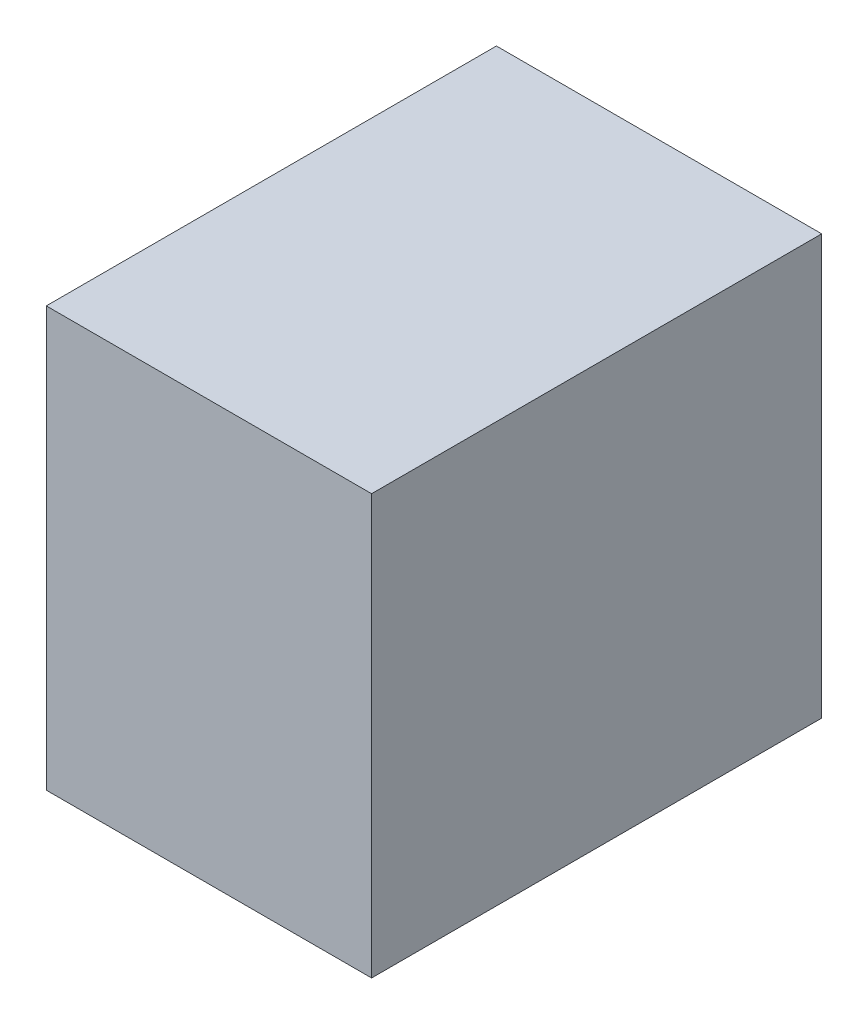
ISO-10303-21;
HEADER;
FILE_DESCRIPTION(('STEP AP214'),'2;1');
FILE_NAME('part.step','',(''),(''),'','','');
FILE_SCHEMA(('AUTOMOTIVE_DESIGN { 1 0 10303 214 1 1 1 1 }'));
ENDSEC;
DATA;
#1=APPLICATION_CONTEXT('core data for automotive mechanical design processes');
#2=APPLICATION_PROTOCOL_DEFINITION('international standard','automotive_design',2000,#1);
#3=PRODUCT_CONTEXT('',#1,'mechanical');
#4=PRODUCT('Part','Part','',(#3));
#5=PRODUCT_RELATED_PRODUCT_CATEGORY('part','',(#4));
#6=PRODUCT_DEFINITION_FORMATION('','',#4);
#7=PRODUCT_DEFINITION_CONTEXT('part definition',#1,'design');
#8=PRODUCT_DEFINITION('design','',#6,#7);
#9=PRODUCT_DEFINITION_SHAPE('','',#8);
#10=(LENGTH_UNIT() NAMED_UNIT(*) SI_UNIT(.MILLI.,.METRE.));
#11=(NAMED_UNIT(*) PLANE_ANGLE_UNIT() SI_UNIT($,.RADIAN.));
#12=(NAMED_UNIT(*) SI_UNIT($,.STERADIAN.) SOLID_ANGLE_UNIT());
#13=UNCERTAINTY_MEASURE_WITH_UNIT(LENGTH_MEASURE(1.E-05),#10,'distance_accuracy_value','');
#14=(GEOMETRIC_REPRESENTATION_CONTEXT(3) GLOBAL_UNCERTAINTY_ASSIGNED_CONTEXT((#13)) GLOBAL_UNIT_ASSIGNED_CONTEXT((#10,
#11,#12)) REPRESENTATION_CONTEXT('',''));
#15=CARTESIAN_POINT('',(0.,0.,0.));
#16=DIRECTION('',(0.,0.,1.));
#17=DIRECTION('',(1.,0.,0.));
#18=AXIS2_PLACEMENT_3D('',#15,#16,#17);
#19=CARTESIAN_POINT('',(1.58999936,2.05000098,0.));
#20=DIRECTION('',(1.,0.,0.));
#21=DIRECTION('',(0.,0.,-1.));
#22=AXIS2_PLACEMENT_3D('',#19,#20,#21);
#23=PLANE('',#22);
#24=DIRECTION('',(0.,0.,-1.));
#25=VECTOR('',#24,1.);
#26=CARTESIAN_POINT('',(1.58999936,-2.05000098,0.));
#27=LINE('',#26,#25);
#28=CARTESIAN_POINT('',(1.58999936,-2.05000098,0.));
#29=VERTEX_POINT('',#28);
#30=CARTESIAN_POINT('',(1.58999936,-2.05000098,4.39999882));
#31=VERTEX_POINT('',#30);
#32=EDGE_CURVE('E20',#29,#31,#27,.F.);
#33=ORIENTED_EDGE('',*,*,#32,.F.);
#34=DIRECTION('',(0.,1.,0.));
#35=VECTOR('',#34,1.);
#36=CARTESIAN_POINT('',(1.58999936,-2.05000098,0.));
#37=LINE('',#36,#35);
#38=CARTESIAN_POINT('',(1.58999936,2.05000098,0.));
#39=VERTEX_POINT('',#38);
#40=EDGE_CURVE('E79',#29,#39,#37,.T.);
#41=ORIENTED_EDGE('',*,*,#40,.T.);
#42=DIRECTION('',(0.,0.,1.));
#43=VECTOR('',#42,1.);
#44=CARTESIAN_POINT('',(1.58999936,2.05000098,0.));
#45=LINE('',#44,#43);
#46=CARTESIAN_POINT('',(1.58999936,2.05000098,4.39999882));
#47=VERTEX_POINT('',#46);
#48=EDGE_CURVE('E61',#47,#39,#45,.F.);
#49=ORIENTED_EDGE('',*,*,#48,.F.);
#50=DIRECTION('',(0.,1.,0.));
#51=VECTOR('',#50,1.);
#52=CARTESIAN_POINT('',(1.58999936,-2.05000098,4.39999882));
#53=LINE('',#52,#51);
#54=EDGE_CURVE('E56',#31,#47,#53,.T.);
#55=ORIENTED_EDGE('',*,*,#54,.F.);
#56=EDGE_LOOP('',(#33,#41,#49,#55));
#57=FACE_BOUND('',#56,.T.);
#58=ADVANCED_FACE('F17',(#57),#23,.T.);
#59=CARTESIAN_POINT('',(1.58999936,-2.05000098,0.));
#60=DIRECTION('',(0.,-1.,0.));
#61=DIRECTION('',(0.,0.,-1.));
#62=AXIS2_PLACEMENT_3D('',#59,#60,#61);
#63=PLANE('',#62);
#64=DIRECTION('',(0.,0.,1.));
#65=VECTOR('',#64,1.);
#66=CARTESIAN_POINT('',(-1.58999936,-2.05000098,0.));
#67=LINE('',#66,#65);
#68=CARTESIAN_POINT('',(-1.58999936,-2.05000098,0.));
#69=VERTEX_POINT('',#68);
#70=CARTESIAN_POINT('',(-1.58999936,-2.05000098,4.39999882));
#71=VERTEX_POINT('',#70);
#72=EDGE_CURVE('E83',#69,#71,#67,.T.);
#73=ORIENTED_EDGE('',*,*,#72,.F.);
#74=DIRECTION('',(1.,0.,0.));
#75=VECTOR('',#74,1.);
#76=CARTESIAN_POINT('',(1.58999936,-2.05000098,0.));
#77=LINE('',#76,#75);
#78=EDGE_CURVE('E68',#69,#29,#77,.T.);
#79=ORIENTED_EDGE('',*,*,#78,.T.);
#80=ORIENTED_EDGE('',*,*,#32,.T.);
#81=DIRECTION('',(1.,0.,0.));
#82=VECTOR('',#81,1.);
#83=CARTESIAN_POINT('',(1.58999936,-2.05000098,4.39999882));
#84=LINE('',#83,#82);
#85=EDGE_CURVE('E63',#71,#31,#84,.T.);
#86=ORIENTED_EDGE('',*,*,#85,.F.);
#87=EDGE_LOOP('',(#73,#79,#80,#86));
#88=FACE_BOUND('',#87,.T.);
#89=ADVANCED_FACE('F65',(#88),#63,.T.);
#90=CARTESIAN_POINT('',(1.58999936,-2.05000098,4.39999882));
#91=DIRECTION('',(0.,0.,1.));
#92=DIRECTION('',(1.,0.,0.));
#93=AXIS2_PLACEMENT_3D('',#90,#91,#92);
#94=PLANE('',#93);
#95=DIRECTION('',(0.,1.,0.));
#96=VECTOR('',#95,1.);
#97=CARTESIAN_POINT('',(-1.58999936,-2.05000098,4.39999882));
#98=LINE('',#97,#96);
#99=CARTESIAN_POINT('',(-1.58999936,2.05000098,4.39999882));
#100=VERTEX_POINT('',#99);
#101=EDGE_CURVE('E72',#71,#100,#98,.T.);
#102=ORIENTED_EDGE('',*,*,#101,.F.);
#103=ORIENTED_EDGE('',*,*,#85,.T.);
#104=ORIENTED_EDGE('',*,*,#54,.T.);
#105=DIRECTION('',(1.,0.,0.));
#106=VECTOR('',#105,1.);
#107=CARTESIAN_POINT('',(-1.58999936,2.05000098,4.39999882));
#108=LINE('',#107,#106);
#109=EDGE_CURVE('E74',#100,#47,#108,.T.);
#110=ORIENTED_EDGE('',*,*,#109,.F.);
#111=EDGE_LOOP('',(#102,#103,#104,#110));
#112=FACE_BOUND('',#111,.T.);
#113=ADVANCED_FACE('F70',(#112),#94,.T.);
#114=CARTESIAN_POINT('',(-1.58999936,2.05000098,0.));
#115=DIRECTION('',(0.,1.,0.));
#116=DIRECTION('',(0.,0.,1.));
#117=AXIS2_PLACEMENT_3D('',#114,#115,#116);
#118=PLANE('',#117);
#119=ORIENTED_EDGE('',*,*,#48,.T.);
#120=DIRECTION('',(1.,0.,0.));
#121=VECTOR('',#120,1.);
#122=CARTESIAN_POINT('',(1.58999936,2.05000098,0.));
#123=LINE('',#122,#121);
#124=CARTESIAN_POINT('',(-1.58999936,2.05000098,0.));
#125=VERTEX_POINT('',#124);
#126=EDGE_CURVE('E35',#39,#125,#123,.F.);
#127=ORIENTED_EDGE('',*,*,#126,.T.);
#128=DIRECTION('',(0.,0.,1.));
#129=VECTOR('',#128,1.);
#130=CARTESIAN_POINT('',(-1.58999936,2.05000098,0.));
#131=LINE('',#130,#129);
#132=EDGE_CURVE('E26',#100,#125,#131,.F.);
#133=ORIENTED_EDGE('',*,*,#132,.F.);
#134=ORIENTED_EDGE('',*,*,#109,.T.);
#135=EDGE_LOOP('',(#119,#127,#133,#134));
#136=FACE_BOUND('',#135,.T.);
#137=ADVANCED_FACE('F89',(#136),#118,.T.);
#138=CARTESIAN_POINT('',(1.58999936,-2.05000098,0.));
#139=DIRECTION('',(0.,0.,1.));
#140=DIRECTION('',(1.,0.,0.));
#141=AXIS2_PLACEMENT_3D('',#138,#139,#140);
#142=PLANE('',#141);
#143=DIRECTION('',(0.,1.,0.));
#144=VECTOR('',#143,1.);
#145=CARTESIAN_POINT('',(-1.58999936,-2.05000098,0.));
#146=LINE('',#145,#144);
#147=EDGE_CURVE('E11',#125,#69,#146,.F.);
#148=ORIENTED_EDGE('',*,*,#147,.F.);
#149=ORIENTED_EDGE('',*,*,#126,.F.);
#150=ORIENTED_EDGE('',*,*,#40,.F.);
#151=ORIENTED_EDGE('',*,*,#78,.F.);
#152=EDGE_LOOP('',(#148,#149,#150,#151));
#153=FACE_BOUND('',#152,.T.);
#154=ADVANCED_FACE('F91',(#153),#142,.F.);
#155=CARTESIAN_POINT('',(-1.58999936,-2.05000098,0.));
#156=DIRECTION('',(-1.,0.,0.));
#157=DIRECTION('',(0.,0.,1.));
#158=AXIS2_PLACEMENT_3D('',#155,#156,#157);
#159=PLANE('',#158);
#160=ORIENTED_EDGE('',*,*,#132,.T.);
#161=ORIENTED_EDGE('',*,*,#147,.T.);
#162=ORIENTED_EDGE('',*,*,#72,.T.);
#163=ORIENTED_EDGE('',*,*,#101,.T.);
#164=EDGE_LOOP('',(#160,#161,#162,#163));
#165=FACE_BOUND('',#164,.T.);
#166=ADVANCED_FACE('F88',(#165),#159,.T.);
#167=CLOSED_SHELL('',(#58,#89,#113,#137,#154,#166));
#168=MANIFOLD_SOLID_BREP('B1',#167);
#169=ADVANCED_BREP_SHAPE_REPRESENTATION('',(#18,#168),#14);
#170=SHAPE_DEFINITION_REPRESENTATION(#9,#169);
ENDSEC;
END-ISO-10303-21;
